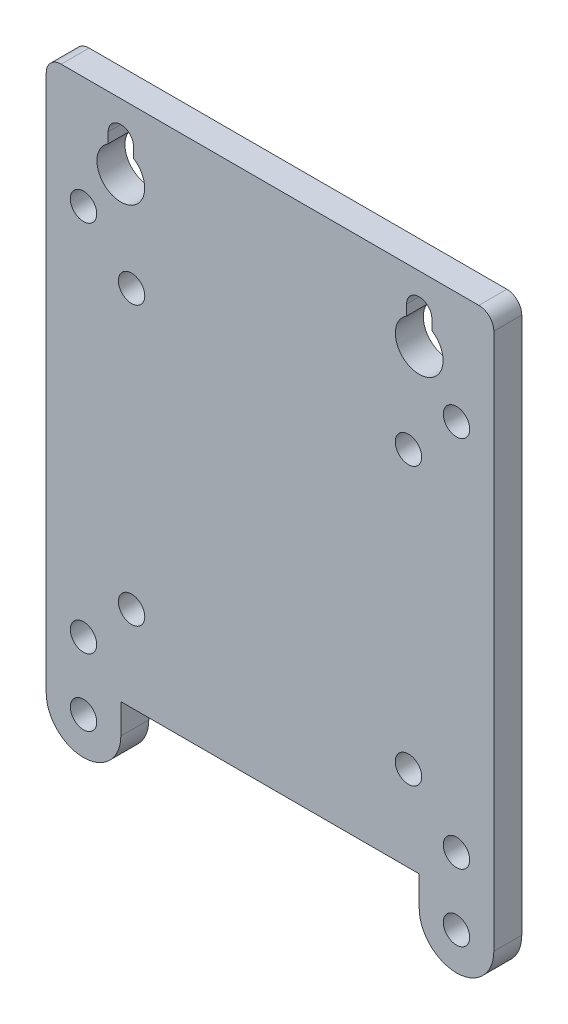
ISO-10303-21;
HEADER;
FILE_DESCRIPTION(('STEP AP214'),'2;1');
FILE_NAME('part.step','',(''),(''),'','','');
FILE_SCHEMA(('AUTOMOTIVE_DESIGN { 1 0 10303 214 1 1 1 1 }'));
ENDSEC;
DATA;
#1=APPLICATION_CONTEXT('core data for automotive mechanical design processes');
#2=APPLICATION_PROTOCOL_DEFINITION('international standard','automotive_design',2000,#1);
#3=PRODUCT_CONTEXT('',#1,'mechanical');
#4=PRODUCT('Part','Part','',(#3));
#5=PRODUCT_RELATED_PRODUCT_CATEGORY('part','',(#4));
#6=PRODUCT_DEFINITION_FORMATION('','',#4);
#7=PRODUCT_DEFINITION_CONTEXT('part definition',#1,'design');
#8=PRODUCT_DEFINITION('design','',#6,#7);
#9=PRODUCT_DEFINITION_SHAPE('','',#8);
#10=(LENGTH_UNIT() NAMED_UNIT(*) SI_UNIT(.MILLI.,.METRE.));
#11=(NAMED_UNIT(*) PLANE_ANGLE_UNIT() SI_UNIT($,.RADIAN.));
#12=(NAMED_UNIT(*) SI_UNIT($,.STERADIAN.) SOLID_ANGLE_UNIT());
#13=UNCERTAINTY_MEASURE_WITH_UNIT(LENGTH_MEASURE(1.E-05),#10,'distance_accuracy_value','');
#14=(GEOMETRIC_REPRESENTATION_CONTEXT(3) GLOBAL_UNCERTAINTY_ASSIGNED_CONTEXT((#13)) GLOBAL_UNIT_ASSIGNED_CONTEXT((#10,
#11,#12)) REPRESENTATION_CONTEXT('',''));
#15=CARTESIAN_POINT('',(0.,0.,0.));
#16=DIRECTION('',(0.,0.,1.));
#17=DIRECTION('',(1.,0.,0.));
#18=AXIS2_PLACEMENT_3D('',#15,#16,#17);
#19=CARTESIAN_POINT('',(-38.1,-38.1,4.7625));
#20=DIRECTION('',(1.,0.,0.));
#21=DIRECTION('',(0.,0.,-1.));
#22=AXIS2_PLACEMENT_3D('',#19,#20,#21);
#23=PLANE('',#22);
#24=DIRECTION('',(0.,-1.,0.));
#25=VECTOR('',#24,1.);
#26=CARTESIAN_POINT('',(-38.1,-38.1,0.));
#27=LINE('',#26,#25);
#28=CARTESIAN_POINT('',(-38.1,48.26,0.));
#29=VERTEX_POINT('',#28);
#30=CARTESIAN_POINT('',(-38.1,-43.18,0.));
#31=VERTEX_POINT('',#30);
#32=EDGE_CURVE('E479',#29,#31,#27,.T.);
#33=ORIENTED_EDGE('',*,*,#32,.T.);
#34=DIRECTION('',(0.,0.,1.));
#35=VECTOR('',#34,1.);
#36=CARTESIAN_POINT('',(-38.1,-43.18,0.));
#37=LINE('',#36,#35);
#38=CARTESIAN_POINT('',(-38.1,-43.18,4.7625));
#39=VERTEX_POINT('',#38);
#40=EDGE_CURVE('E366',#31,#39,#37,.T.);
#41=ORIENTED_EDGE('',*,*,#40,.T.);
#42=DIRECTION('',(0.,-1.,0.));
#43=VECTOR('',#42,1.);
#44=CARTESIAN_POINT('',(-38.1,-38.1,4.7625));
#45=LINE('',#44,#43);
#46=CARTESIAN_POINT('',(-38.1,48.26,4.7625));
#47=VERTEX_POINT('',#46);
#48=EDGE_CURVE('E480',#47,#39,#45,.T.);
#49=ORIENTED_EDGE('',*,*,#48,.F.);
#50=DIRECTION('',(0.,0.,-1.));
#51=VECTOR('',#50,1.);
#52=CARTESIAN_POINT('',(-38.1,48.26,4.7625));
#53=LINE('',#52,#51);
#54=EDGE_CURVE('E503',#47,#29,#53,.T.);
#55=ORIENTED_EDGE('',*,*,#54,.T.);
#56=EDGE_LOOP('',(#33,#41,#49,#55));
#57=FACE_BOUND('',#56,.T.);
#58=ADVANCED_FACE('F181',(#57),#23,.F.);
#59=CARTESIAN_POINT('',(38.1,-38.1,4.7625));
#60=DIRECTION('',(0.,1.,0.));
#61=DIRECTION('',(-1.,0.,0.));
#62=AXIS2_PLACEMENT_3D('',#59,#60,#61);
#63=PLANE('',#62);
#64=DIRECTION('',(1.,0.,0.));
#65=VECTOR('',#64,1.);
#66=CARTESIAN_POINT('',(38.1,-38.1,0.));
#67=LINE('',#66,#65);
#68=CARTESIAN_POINT('',(-25.4,-38.1,0.));
#69=VERTEX_POINT('',#68);
#70=CARTESIAN_POINT('',(25.4,-38.1,0.));
#71=VERTEX_POINT('',#70);
#72=EDGE_CURVE('E317',#69,#71,#67,.T.);
#73=ORIENTED_EDGE('',*,*,#72,.T.);
#74=DIRECTION('',(0.,0.,1.));
#75=VECTOR('',#74,1.);
#76=CARTESIAN_POINT('',(25.4,-38.1,4.7625));
#77=LINE('',#76,#75);
#78=CARTESIAN_POINT('',(25.4,-38.1,4.7625));
#79=VERTEX_POINT('',#78);
#80=EDGE_CURVE('E344',#71,#79,#77,.T.);
#81=ORIENTED_EDGE('',*,*,#80,.T.);
#82=DIRECTION('',(1.,0.,0.));
#83=VECTOR('',#82,1.);
#84=CARTESIAN_POINT('',(38.1,-38.1,4.7625));
#85=LINE('',#84,#83);
#86=CARTESIAN_POINT('',(-25.4,-38.1,4.7625));
#87=VERTEX_POINT('',#86);
#88=EDGE_CURVE('E482',#87,#79,#85,.T.);
#89=ORIENTED_EDGE('',*,*,#88,.F.);
#90=DIRECTION('',(0.,0.,-1.));
#91=VECTOR('',#90,1.);
#92=CARTESIAN_POINT('',(-25.4,-38.1,4.7625));
#93=LINE('',#92,#91);
#94=EDGE_CURVE('E369',#87,#69,#93,.T.);
#95=ORIENTED_EDGE('',*,*,#94,.T.);
#96=EDGE_LOOP('',(#73,#81,#89,#95));
#97=FACE_BOUND('',#96,.T.);
#98=ADVANCED_FACE('F538',(#97),#63,.F.);
#99=CARTESIAN_POINT('',(38.1,-38.1,4.7625));
#100=DIRECTION('',(-1.,0.,0.));
#101=DIRECTION('',(0.,0.,1.));
#102=AXIS2_PLACEMENT_3D('',#99,#100,#101);
#103=PLANE('',#102);
#104=DIRECTION('',(0.,1.,0.));
#105=VECTOR('',#104,1.);
#106=CARTESIAN_POINT('',(38.1,-38.1,4.7625));
#107=LINE('',#106,#105);
#108=CARTESIAN_POINT('',(38.1,-43.18,4.7625));
#109=VERTEX_POINT('',#108);
#110=CARTESIAN_POINT('',(38.1,48.26,4.7625));
#111=VERTEX_POINT('',#110);
#112=EDGE_CURVE('E323',#109,#111,#107,.T.);
#113=ORIENTED_EDGE('',*,*,#112,.F.);
#114=DIRECTION('',(0.,0.,1.));
#115=VECTOR('',#114,1.);
#116=CARTESIAN_POINT('',(38.1,-43.18,0.));
#117=LINE('',#116,#115);
#118=CARTESIAN_POINT('',(38.1,-43.18,0.));
#119=VERTEX_POINT('',#118);
#120=EDGE_CURVE('E320',#119,#109,#117,.T.);
#121=ORIENTED_EDGE('',*,*,#120,.F.);
#122=DIRECTION('',(0.,1.,0.));
#123=VECTOR('',#122,1.);
#124=CARTESIAN_POINT('',(38.1,-38.1,0.));
#125=LINE('',#124,#123);
#126=CARTESIAN_POINT('',(38.1,48.26,0.));
#127=VERTEX_POINT('',#126);
#128=EDGE_CURVE('E305',#119,#127,#125,.T.);
#129=ORIENTED_EDGE('',*,*,#128,.T.);
#130=DIRECTION('',(0.,0.,-1.));
#131=VECTOR('',#130,1.);
#132=CARTESIAN_POINT('',(38.1,48.26,4.7625));
#133=LINE('',#132,#131);
#134=EDGE_CURVE('E489',#127,#111,#133,.F.);
#135=ORIENTED_EDGE('',*,*,#134,.T.);
#136=EDGE_LOOP('',(#113,#121,#129,#135));
#137=FACE_BOUND('',#136,.T.);
#138=ADVANCED_FACE('F321',(#137),#103,.F.);
#139=CARTESIAN_POINT('',(38.1,50.8,4.7625));
#140=DIRECTION('',(0.,-1.,0.));
#141=DIRECTION('',(1.,0.,0.));
#142=AXIS2_PLACEMENT_3D('',#139,#140,#141);
#143=PLANE('',#142);
#144=DIRECTION('',(-1.,0.,0.));
#145=VECTOR('',#144,1.);
#146=CARTESIAN_POINT('',(38.1,50.8,0.));
#147=LINE('',#146,#145);
#148=CARTESIAN_POINT('',(35.56,50.8,0.));
#149=VERTEX_POINT('',#148);
#150=CARTESIAN_POINT('',(-35.56,50.8,0.));
#151=VERTEX_POINT('',#150);
#152=EDGE_CURVE('E316',#149,#151,#147,.T.);
#153=ORIENTED_EDGE('',*,*,#152,.T.);
#154=DIRECTION('',(0.,0.,-1.));
#155=VECTOR('',#154,1.);
#156=CARTESIAN_POINT('',(-35.56,50.8,4.7625));
#157=LINE('',#156,#155);
#158=CARTESIAN_POINT('',(-35.56,50.8,4.7625));
#159=VERTEX_POINT('',#158);
#160=EDGE_CURVE('E509',#151,#159,#157,.F.);
#161=ORIENTED_EDGE('',*,*,#160,.T.);
#162=DIRECTION('',(-1.,0.,0.));
#163=VECTOR('',#162,1.);
#164=CARTESIAN_POINT('',(38.1,50.8,4.7625));
#165=LINE('',#164,#163);
#166=CARTESIAN_POINT('',(35.56,50.8,4.7625));
#167=VERTEX_POINT('',#166);
#168=EDGE_CURVE('E486',#167,#159,#165,.T.);
#169=ORIENTED_EDGE('',*,*,#168,.F.);
#170=DIRECTION('',(0.,0.,-1.));
#171=VECTOR('',#170,1.);
#172=CARTESIAN_POINT('',(35.56,50.8,4.7625));
#173=LINE('',#172,#171);
#174=EDGE_CURVE('E506',#167,#149,#173,.T.);
#175=ORIENTED_EDGE('',*,*,#174,.T.);
#176=EDGE_LOOP('',(#153,#161,#169,#175));
#177=FACE_BOUND('',#176,.T.);
#178=ADVANCED_FACE('F655',(#177),#143,.F.);
#179=CARTESIAN_POINT('',(0.,0.,4.7625));
#180=DIRECTION('',(0.,0.,1.));
#181=DIRECTION('',(1.,0.,0.));
#182=AXIS2_PLACEMENT_3D('',#179,#180,#181);
#183=PLANE('',#182);
#184=ORIENTED_EDGE('',*,*,#88,.T.);
#185=DIRECTION('',(0.,-1.,0.));
#186=VECTOR('',#185,1.);
#187=CARTESIAN_POINT('',(25.4,-35.56,4.7625));
#188=LINE('',#187,#186);
#189=CARTESIAN_POINT('',(25.4,-43.18,4.7625));
#190=VERTEX_POINT('',#189);
#191=EDGE_CURVE('E333',#79,#190,#188,.T.);
#192=ORIENTED_EDGE('',*,*,#191,.T.);
#193=CARTESIAN_POINT('',(31.75,-43.18,4.7625));
#194=DIRECTION('',(0.,0.,1.));
#195=DIRECTION('',(-1.,0.,0.));
#196=AXIS2_PLACEMENT_3D('',#193,#194,#195);
#197=CIRCLE('',#196,6.34999999999999);
#198=EDGE_CURVE('E336',#190,#109,#197,.T.);
#199=ORIENTED_EDGE('',*,*,#198,.T.);
#200=ORIENTED_EDGE('',*,*,#112,.T.);
#201=CARTESIAN_POINT('',(35.56,48.26,4.7625));
#202=DIRECTION('',(0.,0.,1.));
#203=DIRECTION('',(1.,0.,0.));
#204=AXIS2_PLACEMENT_3D('',#201,#202,#203);
#205=CIRCLE('',#204,2.54);
#206=EDGE_CURVE('E499',#111,#167,#205,.T.);
#207=ORIENTED_EDGE('',*,*,#206,.T.);
#208=ORIENTED_EDGE('',*,*,#168,.T.);
#209=CARTESIAN_POINT('',(-35.56,48.26,4.7625));
#210=DIRECTION('',(0.,0.,1.));
#211=DIRECTION('',(1.,0.,0.));
#212=AXIS2_PLACEMENT_3D('',#209,#210,#211);
#213=CIRCLE('',#212,2.54);
#214=EDGE_CURVE('E501',#159,#47,#213,.T.);
#215=ORIENTED_EDGE('',*,*,#214,.T.);
#216=ORIENTED_EDGE('',*,*,#48,.T.);
#217=CARTESIAN_POINT('',(-31.75,-43.18,4.7625));
#218=DIRECTION('',(0.,0.,1.));
#219=DIRECTION('',(1.,0.,0.));
#220=AXIS2_PLACEMENT_3D('',#217,#218,#219);
#221=CIRCLE('',#220,6.34999999999999);
#222=CARTESIAN_POINT('',(-25.4,-43.18,4.7625));
#223=VERTEX_POINT('',#222);
#224=EDGE_CURVE('E352',#39,#223,#221,.T.);
#225=ORIENTED_EDGE('',*,*,#224,.T.);
#226=DIRECTION('',(0.,1.,0.));
#227=VECTOR('',#226,1.);
#228=CARTESIAN_POINT('',(-25.4,-35.56,4.7625));
#229=LINE('',#228,#227);
#230=EDGE_CURVE('E359',#223,#87,#229,.T.);
#231=ORIENTED_EDGE('',*,*,#230,.T.);
#232=EDGE_LOOP('',(#184,#192,#199,#200,#207,#208,#215,#216,#225,#231));
#233=FACE_BOUND('',#232,.T.);
#234=CARTESIAN_POINT('',(-31.75,31.75,4.7625));
#235=DIRECTION('',(0.,0.,-1.));
#236=DIRECTION('',(-1.,0.,0.));
#237=AXIS2_PLACEMENT_3D('',#234,#235,#236);
#238=CIRCLE('',#237,2.2479);
#239=CARTESIAN_POINT('',(-33.9979,31.75,4.7625));
#240=VERTEX_POINT('',#239);
#241=EDGE_CURVE('E376',#240,#240,#238,.T.);
#242=ORIENTED_EDGE('',*,*,#241,.T.);
#243=EDGE_LOOP('',(#242));
#244=FACE_BOUND('',#243,.T.);
#245=CARTESIAN_POINT('',(-31.75,-31.75,4.7625));
#246=DIRECTION('',(0.,0.,-1.));
#247=DIRECTION('',(-1.,0.,0.));
#248=AXIS2_PLACEMENT_3D('',#245,#246,#247);
#249=CIRCLE('',#248,2.2479);
#250=CARTESIAN_POINT('',(-33.9979,-31.75,4.7625));
#251=VERTEX_POINT('',#250);
#252=EDGE_CURVE('E382',#251,#251,#249,.T.);
#253=ORIENTED_EDGE('',*,*,#252,.T.);
#254=EDGE_LOOP('',(#253));
#255=FACE_BOUND('',#254,.T.);
#256=CARTESIAN_POINT('',(31.75,-31.75,4.7625));
#257=DIRECTION('',(0.,0.,-1.));
#258=DIRECTION('',(-1.,0.,0.));
#259=AXIS2_PLACEMENT_3D('',#256,#257,#258);
#260=CIRCLE('',#259,2.2479);
#261=CARTESIAN_POINT('',(29.5021,-31.75,4.7625));
#262=VERTEX_POINT('',#261);
#263=EDGE_CURVE('E388',#262,#262,#260,.T.);
#264=ORIENTED_EDGE('',*,*,#263,.T.);
#265=EDGE_LOOP('',(#264));
#266=FACE_BOUND('',#265,.T.);
#267=CARTESIAN_POINT('',(31.75,31.75,4.7625));
#268=DIRECTION('',(0.,0.,-1.));
#269=DIRECTION('',(-1.,0.,0.));
#270=AXIS2_PLACEMENT_3D('',#267,#268,#269);
#271=CIRCLE('',#270,2.2479);
#272=CARTESIAN_POINT('',(29.5021,31.75,4.7625));
#273=VERTEX_POINT('',#272);
#274=EDGE_CURVE('E394',#273,#273,#271,.T.);
#275=ORIENTED_EDGE('',*,*,#274,.T.);
#276=EDGE_LOOP('',(#275));
#277=FACE_BOUND('',#276,.T.);
#278=CARTESIAN_POINT('',(-25.4,39.61765,4.7625));
#279=DIRECTION('',(0.,0.,-1.));
#280=DIRECTION('',(1.,0.,0.));
#281=AXIS2_PLACEMENT_3D('',#278,#279,#280);
#282=CIRCLE('',#281,4.06400000000001);
#283=CARTESIAN_POINT('',(-23.24735,43.0647058419469,4.7625));
#284=VERTEX_POINT('',#283);
#285=CARTESIAN_POINT('',(-27.55265,43.0647058419469,4.7625));
#286=VERTEX_POINT('',#285);
#287=EDGE_CURVE('E196',#284,#286,#282,.T.);
#288=ORIENTED_EDGE('',*,*,#287,.T.);
#289=DIRECTION('',(0.,-1.,0.));
#290=VECTOR('',#289,1.);
#291=CARTESIAN_POINT('',(-27.55265,44.83735,4.7625));
#292=LINE('',#291,#290);
#293=CARTESIAN_POINT('',(-27.55265,44.83735,4.7625));
#294=VERTEX_POINT('',#293);
#295=EDGE_CURVE('E438',#294,#286,#292,.T.);
#296=ORIENTED_EDGE('',*,*,#295,.F.);
#297=CARTESIAN_POINT('',(-25.4,44.83735,4.7625));
#298=DIRECTION('',(0.,0.,-1.));
#299=DIRECTION('',(-1.,0.,0.));
#300=AXIS2_PLACEMENT_3D('',#297,#298,#299);
#301=CIRCLE('',#300,2.15265);
#302=CARTESIAN_POINT('',(-23.24735,44.83735,4.7625));
#303=VERTEX_POINT('',#302);
#304=EDGE_CURVE('E450',#294,#303,#301,.T.);
#305=ORIENTED_EDGE('',*,*,#304,.T.);
#306=DIRECTION('',(0.,-1.,0.));
#307=VECTOR('',#306,1.);
#308=CARTESIAN_POINT('',(-23.24735,44.83735,4.7625));
#309=LINE('',#308,#307);
#310=EDGE_CURVE('E435',#303,#284,#309,.T.);
#311=ORIENTED_EDGE('',*,*,#310,.T.);
#312=EDGE_LOOP('',(#288,#296,#305,#311));
#313=FACE_BOUND('',#312,.T.);
#314=CARTESIAN_POINT('',(25.4,39.61765,4.7625));
#315=DIRECTION('',(0.,0.,-1.));
#316=DIRECTION('',(-1.,0.,0.));
#317=AXIS2_PLACEMENT_3D('',#314,#315,#316);
#318=CIRCLE('',#317,4.064);
#319=CARTESIAN_POINT('',(27.55265,43.0647058419469,4.7625));
#320=VERTEX_POINT('',#319);
#321=CARTESIAN_POINT('',(23.24735,43.0647058419469,4.7625));
#322=VERTEX_POINT('',#321);
#323=EDGE_CURVE('E203',#320,#322,#318,.T.);
#324=ORIENTED_EDGE('',*,*,#323,.T.);
#325=DIRECTION('',(0.,-1.,0.));
#326=VECTOR('',#325,1.);
#327=CARTESIAN_POINT('',(23.24735,44.83735,4.7625));
#328=LINE('',#327,#326);
#329=CARTESIAN_POINT('',(23.24735,44.83735,4.7625));
#330=VERTEX_POINT('',#329);
#331=EDGE_CURVE('E415',#330,#322,#328,.T.);
#332=ORIENTED_EDGE('',*,*,#331,.F.);
#333=CARTESIAN_POINT('',(25.4,44.83735,4.7625));
#334=DIRECTION('',(0.,0.,-1.));
#335=DIRECTION('',(-1.,0.,0.));
#336=AXIS2_PLACEMENT_3D('',#333,#334,#335);
#337=CIRCLE('',#336,2.15265);
#338=CARTESIAN_POINT('',(27.55265,44.83735,4.7625));
#339=VERTEX_POINT('',#338);
#340=EDGE_CURVE('E427',#330,#339,#337,.T.);
#341=ORIENTED_EDGE('',*,*,#340,.T.);
#342=DIRECTION('',(0.,-1.,0.));
#343=VECTOR('',#342,1.);
#344=CARTESIAN_POINT('',(27.55265,44.83735,4.7625));
#345=LINE('',#344,#343);
#346=EDGE_CURVE('E412',#339,#320,#345,.T.);
#347=ORIENTED_EDGE('',*,*,#346,.T.);
#348=EDGE_LOOP('',(#324,#332,#341,#347));
#349=FACE_BOUND('',#348,.T.);
#350=CARTESIAN_POINT('',(23.5700000000001,23.5700000000001,4.7625));
#351=DIRECTION('',(0.,0.,1.));
#352=DIRECTION('',(1.,0.,0.));
#353=AXIS2_PLACEMENT_3D('',#350,#351,#352);
#354=CIRCLE('',#353,2.2479);
#355=CARTESIAN_POINT('',(25.8179000000001,23.5700000000001,4.7625));
#356=VERTEX_POINT('',#355);
#357=EDGE_CURVE('E455',#356,#356,#354,.T.);
#358=ORIENTED_EDGE('',*,*,#357,.F.);
#359=EDGE_LOOP('',(#358));
#360=FACE_BOUND('',#359,.T.);
#361=CARTESIAN_POINT('',(-23.57,23.755,4.7625));
#362=DIRECTION('',(0.,0.,1.));
#363=DIRECTION('',(1.,0.,0.));
#364=AXIS2_PLACEMENT_3D('',#361,#362,#363);
#365=CIRCLE('',#364,2.2479);
#366=CARTESIAN_POINT('',(-21.3221,23.755,4.7625));
#367=VERTEX_POINT('',#366);
#368=EDGE_CURVE('E461',#367,#367,#365,.T.);
#369=ORIENTED_EDGE('',*,*,#368,.F.);
#370=EDGE_LOOP('',(#369));
#371=FACE_BOUND('',#370,.T.);
#372=CARTESIAN_POINT('',(23.5700000000001,-23.5699999999999,4.7625));
#373=DIRECTION('',(0.,0.,1.));
#374=DIRECTION('',(1.,0.,0.));
#375=AXIS2_PLACEMENT_3D('',#372,#373,#374);
#376=CIRCLE('',#375,2.2479);
#377=CARTESIAN_POINT('',(25.8179000000001,-23.5699999999999,4.7625));
#378=VERTEX_POINT('',#377);
#379=EDGE_CURVE('E467',#378,#378,#376,.T.);
#380=ORIENTED_EDGE('',*,*,#379,.F.);
#381=EDGE_LOOP('',(#380));
#382=FACE_BOUND('',#381,.T.);
#383=CARTESIAN_POINT('',(-23.57,-23.5699999999999,4.7625));
#384=DIRECTION('',(0.,0.,1.));
#385=DIRECTION('',(1.,0.,0.));
#386=AXIS2_PLACEMENT_3D('',#383,#384,#385);
#387=CIRCLE('',#386,2.2479);
#388=CARTESIAN_POINT('',(-21.3221,-23.5699999999999,4.7625));
#389=VERTEX_POINT('',#388);
#390=EDGE_CURVE('E473',#389,#389,#387,.T.);
#391=ORIENTED_EDGE('',*,*,#390,.F.);
#392=EDGE_LOOP('',(#391));
#393=FACE_BOUND('',#392,.T.);
#394=CARTESIAN_POINT('',(-31.75,-43.18,4.7625));
#395=DIRECTION('',(0.,0.,1.));
#396=DIRECTION('',(1.,0.,0.));
#397=AXIS2_PLACEMENT_3D('',#394,#395,#396);
#398=CIRCLE('',#397,2.2479);
#399=CARTESIAN_POINT('',(-29.5021,-43.18,4.7625));
#400=VERTEX_POINT('',#399);
#401=EDGE_CURVE('E348',#400,#400,#398,.T.);
#402=ORIENTED_EDGE('',*,*,#401,.F.);
#403=EDGE_LOOP('',(#402));
#404=FACE_BOUND('',#403,.T.);
#405=CARTESIAN_POINT('',(31.75,-43.18,4.7625));
#406=DIRECTION('',(0.,0.,1.));
#407=DIRECTION('',(-1.,0.,0.));
#408=AXIS2_PLACEMENT_3D('',#405,#406,#407);
#409=CIRCLE('',#408,2.2479);
#410=CARTESIAN_POINT('',(33.9979,-43.18,4.7625));
#411=VERTEX_POINT('',#410);
#412=EDGE_CURVE('E339',#411,#411,#409,.T.);
#413=ORIENTED_EDGE('',*,*,#412,.F.);
#414=EDGE_LOOP('',(#413));
#415=FACE_BOUND('',#414,.T.);
#416=ADVANCED_FACE('F515',(#233,#244,#255,#266,#277,#313,#349,#360,#371,#382,#393,#404,#415),
#183,.T.);
#417=CARTESIAN_POINT('',(0.,0.,0.));
#418=DIRECTION('',(0.,0.,1.));
#419=DIRECTION('',(1.,0.,0.));
#420=AXIS2_PLACEMENT_3D('',#417,#418,#419);
#421=PLANE('',#420);
#422=DIRECTION('',(0.,-1.,0.));
#423=VECTOR('',#422,1.);
#424=CARTESIAN_POINT('',(25.4,-35.56,0.));
#425=LINE('',#424,#423);
#426=CARTESIAN_POINT('',(25.4,-43.18,0.));
#427=VERTEX_POINT('',#426);
#428=EDGE_CURVE('E328',#71,#427,#425,.T.);
#429=ORIENTED_EDGE('',*,*,#428,.F.);
#430=ORIENTED_EDGE('',*,*,#72,.F.);
#431=DIRECTION('',(0.,1.,0.));
#432=VECTOR('',#431,1.);
#433=CARTESIAN_POINT('',(-25.4,-35.56,0.));
#434=LINE('',#433,#432);
#435=CARTESIAN_POINT('',(-25.4,-43.18,0.));
#436=VERTEX_POINT('',#435);
#437=EDGE_CURVE('E358',#436,#69,#434,.T.);
#438=ORIENTED_EDGE('',*,*,#437,.F.);
#439=CARTESIAN_POINT('',(-31.75,-43.18,0.));
#440=DIRECTION('',(0.,0.,1.));
#441=DIRECTION('',(1.,0.,0.));
#442=AXIS2_PLACEMENT_3D('',#439,#440,#441);
#443=CIRCLE('',#442,6.34999999999999);
#444=EDGE_CURVE('E355',#31,#436,#443,.T.);
#445=ORIENTED_EDGE('',*,*,#444,.F.);
#446=ORIENTED_EDGE('',*,*,#32,.F.);
#447=CARTESIAN_POINT('',(-35.56,48.26,0.));
#448=DIRECTION('',(0.,0.,1.));
#449=DIRECTION('',(1.,0.,0.));
#450=AXIS2_PLACEMENT_3D('',#447,#448,#449);
#451=CIRCLE('',#450,2.54);
#452=EDGE_CURVE('E497',#29,#151,#451,.F.);
#453=ORIENTED_EDGE('',*,*,#452,.T.);
#454=ORIENTED_EDGE('',*,*,#152,.F.);
#455=CARTESIAN_POINT('',(35.56,48.26,0.));
#456=DIRECTION('',(0.,0.,1.));
#457=DIRECTION('',(1.,0.,0.));
#458=AXIS2_PLACEMENT_3D('',#455,#456,#457);
#459=CIRCLE('',#458,2.54);
#460=EDGE_CURVE('E313',#149,#127,#459,.F.);
#461=ORIENTED_EDGE('',*,*,#460,.T.);
#462=ORIENTED_EDGE('',*,*,#128,.F.);
#463=CARTESIAN_POINT('',(31.75,-43.18,0.));
#464=DIRECTION('',(0.,0.,1.));
#465=DIRECTION('',(-1.,0.,0.));
#466=AXIS2_PLACEMENT_3D('',#463,#464,#465);
#467=CIRCLE('',#466,6.34999999999999);
#468=EDGE_CURVE('E311',#427,#119,#467,.T.);
#469=ORIENTED_EDGE('',*,*,#468,.F.);
#470=EDGE_LOOP('',(#429,#430,#438,#445,#446,#453,#454,#461,#462,#469));
#471=FACE_BOUND('',#470,.T.);
#472=CARTESIAN_POINT('',(-31.75,31.75,0.));
#473=DIRECTION('',(0.,0.,-1.));
#474=DIRECTION('',(-1.,0.,0.));
#475=AXIS2_PLACEMENT_3D('',#472,#473,#474);
#476=CIRCLE('',#475,2.2479);
#477=CARTESIAN_POINT('',(-33.9979,31.75,0.));
#478=VERTEX_POINT('',#477);
#479=EDGE_CURVE('E373',#478,#478,#476,.T.);
#480=ORIENTED_EDGE('',*,*,#479,.F.);
#481=EDGE_LOOP('',(#480));
#482=FACE_BOUND('',#481,.T.);
#483=CARTESIAN_POINT('',(-31.75,-31.75,0.));
#484=DIRECTION('',(0.,0.,-1.));
#485=DIRECTION('',(-1.,0.,0.));
#486=AXIS2_PLACEMENT_3D('',#483,#484,#485);
#487=CIRCLE('',#486,2.2479);
#488=CARTESIAN_POINT('',(-33.9979,-31.75,0.));
#489=VERTEX_POINT('',#488);
#490=EDGE_CURVE('E379',#489,#489,#487,.T.);
#491=ORIENTED_EDGE('',*,*,#490,.F.);
#492=EDGE_LOOP('',(#491));
#493=FACE_BOUND('',#492,.T.);
#494=CARTESIAN_POINT('',(31.75,-31.75,0.));
#495=DIRECTION('',(0.,0.,-1.));
#496=DIRECTION('',(-1.,0.,0.));
#497=AXIS2_PLACEMENT_3D('',#494,#495,#496);
#498=CIRCLE('',#497,2.2479);
#499=CARTESIAN_POINT('',(29.5021,-31.75,0.));
#500=VERTEX_POINT('',#499);
#501=EDGE_CURVE('E385',#500,#500,#498,.T.);
#502=ORIENTED_EDGE('',*,*,#501,.F.);
#503=EDGE_LOOP('',(#502));
#504=FACE_BOUND('',#503,.T.);
#505=CARTESIAN_POINT('',(31.75,31.75,0.));
#506=DIRECTION('',(0.,0.,-1.));
#507=DIRECTION('',(-1.,0.,0.));
#508=AXIS2_PLACEMENT_3D('',#505,#506,#507);
#509=CIRCLE('',#508,2.2479);
#510=CARTESIAN_POINT('',(29.5021,31.75,0.));
#511=VERTEX_POINT('',#510);
#512=EDGE_CURVE('E391',#511,#511,#509,.T.);
#513=ORIENTED_EDGE('',*,*,#512,.F.);
#514=EDGE_LOOP('',(#513));
#515=FACE_BOUND('',#514,.T.);
#516=DIRECTION('',(0.,-1.,0.));
#517=VECTOR('',#516,1.);
#518=CARTESIAN_POINT('',(23.24735,44.83735,0.));
#519=LINE('',#518,#517);
#520=CARTESIAN_POINT('',(23.2473500000001,44.83735,0.));
#521=VERTEX_POINT('',#520);
#522=CARTESIAN_POINT('',(23.24735,43.0647058419469,0.));
#523=VERTEX_POINT('',#522);
#524=EDGE_CURVE('E418',#521,#523,#519,.T.);
#525=ORIENTED_EDGE('',*,*,#524,.T.);
#526=CARTESIAN_POINT('',(25.4,39.61765,0.));
#527=DIRECTION('',(0.,0.,-1.));
#528=DIRECTION('',(-1.,0.,0.));
#529=AXIS2_PLACEMENT_3D('',#526,#527,#528);
#530=CIRCLE('',#529,4.064);
#531=CARTESIAN_POINT('',(27.55265,43.0647058419469,0.));
#532=VERTEX_POINT('',#531);
#533=EDGE_CURVE('E403',#532,#523,#530,.T.);
#534=ORIENTED_EDGE('',*,*,#533,.F.);
#535=DIRECTION('',(0.,-1.,0.));
#536=VECTOR('',#535,1.);
#537=CARTESIAN_POINT('',(27.55265,44.83735,0.));
#538=LINE('',#537,#536);
#539=CARTESIAN_POINT('',(27.55265,44.83735,0.));
#540=VERTEX_POINT('',#539);
#541=EDGE_CURVE('E409',#540,#532,#538,.T.);
#542=ORIENTED_EDGE('',*,*,#541,.F.);
#543=CARTESIAN_POINT('',(25.4,44.83735,0.));
#544=DIRECTION('',(0.,0.,-1.));
#545=DIRECTION('',(-1.,0.,0.));
#546=AXIS2_PLACEMENT_3D('',#543,#544,#545);
#547=CIRCLE('',#546,2.15265);
#548=EDGE_CURVE('E424',#521,#540,#547,.T.);
#549=ORIENTED_EDGE('',*,*,#548,.F.);
#550=EDGE_LOOP('',(#525,#534,#542,#549));
#551=FACE_BOUND('',#550,.T.);
#552=DIRECTION('',(0.,-1.,0.));
#553=VECTOR('',#552,1.);
#554=CARTESIAN_POINT('',(-27.55265,44.83735,0.));
#555=LINE('',#554,#553);
#556=CARTESIAN_POINT('',(-27.5526500000001,44.83735,0.));
#557=VERTEX_POINT('',#556);
#558=CARTESIAN_POINT('',(-27.55265,43.0647058419469,0.));
#559=VERTEX_POINT('',#558);
#560=EDGE_CURVE('E441',#557,#559,#555,.T.);
#561=ORIENTED_EDGE('',*,*,#560,.T.);
#562=CARTESIAN_POINT('',(-25.4,39.61765,0.));
#563=DIRECTION('',(0.,0.,-1.));
#564=DIRECTION('',(1.,0.,0.));
#565=AXIS2_PLACEMENT_3D('',#562,#563,#564);
#566=CIRCLE('',#565,4.06400000000001);
#567=CARTESIAN_POINT('',(-23.24735,43.0647058419469,0.));
#568=VERTEX_POINT('',#567);
#569=EDGE_CURVE('E397',#568,#559,#566,.T.);
#570=ORIENTED_EDGE('',*,*,#569,.F.);
#571=DIRECTION('',(0.,-1.,0.));
#572=VECTOR('',#571,1.);
#573=CARTESIAN_POINT('',(-23.24735,44.83735,0.));
#574=LINE('',#573,#572);
#575=CARTESIAN_POINT('',(-23.24735,44.83735,0.));
#576=VERTEX_POINT('',#575);
#577=EDGE_CURVE('E432',#576,#568,#574,.T.);
#578=ORIENTED_EDGE('',*,*,#577,.F.);
#579=CARTESIAN_POINT('',(-25.4,44.83735,0.));
#580=DIRECTION('',(0.,0.,-1.));
#581=DIRECTION('',(-1.,0.,0.));
#582=AXIS2_PLACEMENT_3D('',#579,#580,#581);
#583=CIRCLE('',#582,2.15265);
#584=EDGE_CURVE('E447',#557,#576,#583,.T.);
#585=ORIENTED_EDGE('',*,*,#584,.F.);
#586=EDGE_LOOP('',(#561,#570,#578,#585));
#587=FACE_BOUND('',#586,.T.);
#588=CARTESIAN_POINT('',(23.5700000000001,23.5700000000001,0.));
#589=DIRECTION('',(0.,0.,1.));
#590=DIRECTION('',(1.,0.,0.));
#591=AXIS2_PLACEMENT_3D('',#588,#589,#590);
#592=CIRCLE('',#591,2.2479);
#593=CARTESIAN_POINT('',(25.8179,23.5700000000001,0.));
#594=VERTEX_POINT('',#593);
#595=EDGE_CURVE('E458',#594,#594,#592,.T.);
#596=ORIENTED_EDGE('',*,*,#595,.T.);
#597=EDGE_LOOP('',(#596));
#598=FACE_BOUND('',#597,.T.);
#599=CARTESIAN_POINT('',(-23.57,23.755,0.));
#600=DIRECTION('',(0.,0.,1.));
#601=DIRECTION('',(1.,0.,0.));
#602=AXIS2_PLACEMENT_3D('',#599,#600,#601);
#603=CIRCLE('',#602,2.2479);
#604=CARTESIAN_POINT('',(-21.3221,23.755,0.));
#605=VERTEX_POINT('',#604);
#606=EDGE_CURVE('E464',#605,#605,#603,.T.);
#607=ORIENTED_EDGE('',*,*,#606,.T.);
#608=EDGE_LOOP('',(#607));
#609=FACE_BOUND('',#608,.T.);
#610=CARTESIAN_POINT('',(23.5700000000001,-23.5699999999999,0.));
#611=DIRECTION('',(0.,0.,1.));
#612=DIRECTION('',(1.,0.,0.));
#613=AXIS2_PLACEMENT_3D('',#610,#611,#612);
#614=CIRCLE('',#613,2.2479);
#615=CARTESIAN_POINT('',(25.8179000000001,-23.5699999999999,0.));
#616=VERTEX_POINT('',#615);
#617=EDGE_CURVE('E470',#616,#616,#614,.T.);
#618=ORIENTED_EDGE('',*,*,#617,.T.);
#619=EDGE_LOOP('',(#618));
#620=FACE_BOUND('',#619,.T.);
#621=CARTESIAN_POINT('',(-23.57,-23.5699999999999,0.));
#622=DIRECTION('',(0.,0.,1.));
#623=DIRECTION('',(1.,0.,0.));
#624=AXIS2_PLACEMENT_3D('',#621,#622,#623);
#625=CIRCLE('',#624,2.2479);
#626=CARTESIAN_POINT('',(-21.3221,-23.5699999999999,0.));
#627=VERTEX_POINT('',#626);
#628=EDGE_CURVE('E476',#627,#627,#625,.T.);
#629=ORIENTED_EDGE('',*,*,#628,.T.);
#630=EDGE_LOOP('',(#629));
#631=FACE_BOUND('',#630,.T.);
#632=CARTESIAN_POINT('',(-31.75,-43.18,0.));
#633=DIRECTION('',(0.,0.,1.));
#634=DIRECTION('',(1.,0.,0.));
#635=AXIS2_PLACEMENT_3D('',#632,#633,#634);
#636=CIRCLE('',#635,2.2479);
#637=CARTESIAN_POINT('',(-29.5021,-43.18,0.));
#638=VERTEX_POINT('',#637);
#639=EDGE_CURVE('E349',#638,#638,#636,.T.);
#640=ORIENTED_EDGE('',*,*,#639,.T.);
#641=EDGE_LOOP('',(#640));
#642=FACE_BOUND('',#641,.T.);
#643=CARTESIAN_POINT('',(31.75,-43.18,0.));
#644=DIRECTION('',(0.,0.,1.));
#645=DIRECTION('',(-1.,0.,0.));
#646=AXIS2_PLACEMENT_3D('',#643,#644,#645);
#647=CIRCLE('',#646,2.2479);
#648=CARTESIAN_POINT('',(33.9979,-43.18,0.));
#649=VERTEX_POINT('',#648);
#650=EDGE_CURVE('E342',#649,#649,#647,.T.);
#651=ORIENTED_EDGE('',*,*,#650,.T.);
#652=EDGE_LOOP('',(#651));
#653=FACE_BOUND('',#652,.T.);
#654=ADVANCED_FACE('F308',(#471,#482,#493,#504,#515,#551,#587,#598,#609,#620,#631,#642,#653),
#421,.F.);
#655=CARTESIAN_POINT('',(-23.57,-23.5699999999999,4.7625));
#656=DIRECTION('',(0.,0.,1.));
#657=DIRECTION('',(1.,0.,0.));
#658=AXIS2_PLACEMENT_3D('',#655,#656,#657);
#659=CYLINDRICAL_SURFACE('',#658,2.2479);
#660=ORIENTED_EDGE('',*,*,#628,.F.);
#661=EDGE_LOOP('',(#660));
#662=FACE_BOUND('',#661,.T.);
#663=ORIENTED_EDGE('',*,*,#390,.T.);
#664=EDGE_LOOP('',(#663));
#665=FACE_BOUND('',#664,.T.);
#666=ADVANCED_FACE('F672',(#662,#665),#659,.F.);
#667=CARTESIAN_POINT('',(23.5700000000001,-23.5699999999999,4.7625));
#668=DIRECTION('',(0.,0.,1.));
#669=DIRECTION('',(1.,0.,0.));
#670=AXIS2_PLACEMENT_3D('',#667,#668,#669);
#671=CYLINDRICAL_SURFACE('',#670,2.2479);
#672=ORIENTED_EDGE('',*,*,#617,.F.);
#673=EDGE_LOOP('',(#672));
#674=FACE_BOUND('',#673,.T.);
#675=ORIENTED_EDGE('',*,*,#379,.T.);
#676=EDGE_LOOP('',(#675));
#677=FACE_BOUND('',#676,.T.);
#678=ADVANCED_FACE('F747',(#674,#677),#671,.F.);
#679=CARTESIAN_POINT('',(-23.57,23.755,4.7625));
#680=DIRECTION('',(0.,0.,1.));
#681=DIRECTION('',(1.,0.,0.));
#682=AXIS2_PLACEMENT_3D('',#679,#680,#681);
#683=CYLINDRICAL_SURFACE('',#682,2.2479);
#684=ORIENTED_EDGE('',*,*,#606,.F.);
#685=EDGE_LOOP('',(#684));
#686=FACE_BOUND('',#685,.T.);
#687=ORIENTED_EDGE('',*,*,#368,.T.);
#688=EDGE_LOOP('',(#687));
#689=FACE_BOUND('',#688,.T.);
#690=ADVANCED_FACE('F559',(#686,#689),#683,.F.);
#691=CARTESIAN_POINT('',(23.5700000000001,23.5700000000001,4.7625));
#692=DIRECTION('',(0.,0.,1.));
#693=DIRECTION('',(1.,0.,0.));
#694=AXIS2_PLACEMENT_3D('',#691,#692,#693);
#695=CYLINDRICAL_SURFACE('',#694,2.2479);
#696=ORIENTED_EDGE('',*,*,#595,.F.);
#697=EDGE_LOOP('',(#696));
#698=FACE_BOUND('',#697,.T.);
#699=ORIENTED_EDGE('',*,*,#357,.T.);
#700=EDGE_LOOP('',(#699));
#701=FACE_BOUND('',#700,.T.);
#702=ADVANCED_FACE('F551',(#698,#701),#695,.F.);
#703=CARTESIAN_POINT('',(-35.56,48.26,4.7625));
#704=DIRECTION('',(0.,0.,-1.));
#705=DIRECTION('',(-1.,0.,0.));
#706=AXIS2_PLACEMENT_3D('',#703,#704,#705);
#707=CYLINDRICAL_SURFACE('',#706,2.54);
#708=ORIENTED_EDGE('',*,*,#214,.F.);
#709=ORIENTED_EDGE('',*,*,#160,.F.);
#710=ORIENTED_EDGE('',*,*,#452,.F.);
#711=ORIENTED_EDGE('',*,*,#54,.F.);
#712=EDGE_LOOP('',(#708,#709,#710,#711));
#713=FACE_BOUND('',#712,.T.);
#714=ADVANCED_FACE('F549',(#713),#707,.T.);
#715=CARTESIAN_POINT('',(35.56,48.26,4.7625));
#716=DIRECTION('',(0.,0.,-1.));
#717=DIRECTION('',(-1.,0.,0.));
#718=AXIS2_PLACEMENT_3D('',#715,#716,#717);
#719=CYLINDRICAL_SURFACE('',#718,2.54);
#720=ORIENTED_EDGE('',*,*,#206,.F.);
#721=ORIENTED_EDGE('',*,*,#134,.F.);
#722=ORIENTED_EDGE('',*,*,#460,.F.);
#723=ORIENTED_EDGE('',*,*,#174,.F.);
#724=EDGE_LOOP('',(#720,#721,#722,#723));
#725=FACE_BOUND('',#724,.T.);
#726=ADVANCED_FACE('F183',(#725),#719,.T.);
#727=CARTESIAN_POINT('',(-25.4,44.83735,0.));
#728=DIRECTION('',(0.,0.,-1.));
#729=DIRECTION('',(-1.,0.,0.));
#730=AXIS2_PLACEMENT_3D('',#727,#728,#729);
#731=CYLINDRICAL_SURFACE('',#730,2.15265);
#732=ORIENTED_EDGE('',*,*,#584,.T.);
#733=DIRECTION('',(0.,0.,1.));
#734=VECTOR('',#733,1.);
#735=CARTESIAN_POINT('',(-23.24735,44.83735,4.7625));
#736=LINE('',#735,#734);
#737=EDGE_CURVE('E444',#576,#303,#736,.T.);
#738=ORIENTED_EDGE('',*,*,#737,.T.);
#739=ORIENTED_EDGE('',*,*,#304,.F.);
#740=DIRECTION('',(0.,0.,-1.));
#741=VECTOR('',#740,1.);
#742=CARTESIAN_POINT('',(-27.55265,44.83735,0.));
#743=LINE('',#742,#741);
#744=EDGE_CURVE('E453',#557,#294,#743,.F.);
#745=ORIENTED_EDGE('',*,*,#744,.F.);
#746=EDGE_LOOP('',(#732,#738,#739,#745));
#747=FACE_BOUND('',#746,.T.);
#748=ADVANCED_FACE('F557',(#747),#731,.F.);
#749=CARTESIAN_POINT('',(-27.55265,44.83735,0.));
#750=DIRECTION('',(-1.,0.,0.));
#751=DIRECTION('',(0.,0.,1.));
#752=AXIS2_PLACEMENT_3D('',#749,#750,#751);
#753=PLANE('',#752);
#754=ORIENTED_EDGE('',*,*,#295,.T.);
#755=DIRECTION('',(0.,0.,-1.));
#756=VECTOR('',#755,1.);
#757=CARTESIAN_POINT('',(-27.55265,43.0647058419469,4.7625));
#758=LINE('',#757,#756);
#759=EDGE_CURVE('E399',#286,#559,#758,.T.);
#760=ORIENTED_EDGE('',*,*,#759,.T.);
#761=ORIENTED_EDGE('',*,*,#560,.F.);
#762=ORIENTED_EDGE('',*,*,#744,.T.);
#763=EDGE_LOOP('',(#754,#760,#761,#762));
#764=FACE_BOUND('',#763,.T.);
#765=ADVANCED_FACE('F787',(#764),#753,.F.);
#766=CARTESIAN_POINT('',(-23.24735,44.83735,4.7625));
#767=DIRECTION('',(1.,0.,0.));
#768=DIRECTION('',(0.,0.,-1.));
#769=AXIS2_PLACEMENT_3D('',#766,#767,#768);
#770=PLANE('',#769);
#771=ORIENTED_EDGE('',*,*,#577,.T.);
#772=DIRECTION('',(0.,0.,-1.));
#773=VECTOR('',#772,1.);
#774=CARTESIAN_POINT('',(-23.24735,43.0647058419469,4.7625));
#775=LINE('',#774,#773);
#776=EDGE_CURVE('E13',#568,#284,#775,.F.);
#777=ORIENTED_EDGE('',*,*,#776,.T.);
#778=ORIENTED_EDGE('',*,*,#310,.F.);
#779=ORIENTED_EDGE('',*,*,#737,.F.);
#780=EDGE_LOOP('',(#771,#777,#778,#779));
#781=FACE_BOUND('',#780,.T.);
#782=ADVANCED_FACE('F535',(#781),#770,.F.);
#783=CARTESIAN_POINT('',(25.4,44.83735,0.));
#784=DIRECTION('',(0.,0.,-1.));
#785=DIRECTION('',(-1.,0.,0.));
#786=AXIS2_PLACEMENT_3D('',#783,#784,#785);
#787=CYLINDRICAL_SURFACE('',#786,2.15265);
#788=ORIENTED_EDGE('',*,*,#548,.T.);
#789=DIRECTION('',(0.,0.,1.));
#790=VECTOR('',#789,1.);
#791=CARTESIAN_POINT('',(27.55265,44.83735,4.7625));
#792=LINE('',#791,#790);
#793=EDGE_CURVE('E421',#540,#339,#792,.T.);
#794=ORIENTED_EDGE('',*,*,#793,.T.);
#795=ORIENTED_EDGE('',*,*,#340,.F.);
#796=DIRECTION('',(0.,0.,-1.));
#797=VECTOR('',#796,1.);
#798=CARTESIAN_POINT('',(23.24735,44.83735,0.));
#799=LINE('',#798,#797);
#800=EDGE_CURVE('E430',#521,#330,#799,.F.);
#801=ORIENTED_EDGE('',*,*,#800,.F.);
#802=EDGE_LOOP('',(#788,#794,#795,#801));
#803=FACE_BOUND('',#802,.T.);
#804=ADVANCED_FACE('F521',(#803),#787,.F.);
#805=CARTESIAN_POINT('',(23.24735,44.83735,0.));
#806=DIRECTION('',(-1.,0.,0.));
#807=DIRECTION('',(0.,0.,1.));
#808=AXIS2_PLACEMENT_3D('',#805,#806,#807);
#809=PLANE('',#808);
#810=ORIENTED_EDGE('',*,*,#331,.T.);
#811=DIRECTION('',(0.,0.,-1.));
#812=VECTOR('',#811,1.);
#813=CARTESIAN_POINT('',(23.24735,43.0647058419469,4.7625));
#814=LINE('',#813,#812);
#815=EDGE_CURVE('E405',#322,#523,#814,.T.);
#816=ORIENTED_EDGE('',*,*,#815,.T.);
#817=ORIENTED_EDGE('',*,*,#524,.F.);
#818=ORIENTED_EDGE('',*,*,#800,.T.);
#819=EDGE_LOOP('',(#810,#816,#817,#818));
#820=FACE_BOUND('',#819,.T.);
#821=ADVANCED_FACE('F527',(#820),#809,.F.);
#822=CARTESIAN_POINT('',(27.55265,44.83735,4.7625));
#823=DIRECTION('',(1.,0.,0.));
#824=DIRECTION('',(0.,0.,-1.));
#825=AXIS2_PLACEMENT_3D('',#822,#823,#824);
#826=PLANE('',#825);
#827=ORIENTED_EDGE('',*,*,#541,.T.);
#828=DIRECTION('',(0.,0.,-1.));
#829=VECTOR('',#828,1.);
#830=CARTESIAN_POINT('',(27.55265,43.0647058419469,4.7625));
#831=LINE('',#830,#829);
#832=EDGE_CURVE('E189',#532,#320,#831,.F.);
#833=ORIENTED_EDGE('',*,*,#832,.T.);
#834=ORIENTED_EDGE('',*,*,#346,.F.);
#835=ORIENTED_EDGE('',*,*,#793,.F.);
#836=EDGE_LOOP('',(#827,#833,#834,#835));
#837=FACE_BOUND('',#836,.T.);
#838=ADVANCED_FACE('F511',(#837),#826,.F.);
#839=CARTESIAN_POINT('',(25.4,39.61765,4.7625));
#840=DIRECTION('',(0.,0.,-1.));
#841=DIRECTION('',(-1.,0.,0.));
#842=AXIS2_PLACEMENT_3D('',#839,#840,#841);
#843=CYLINDRICAL_SURFACE('',#842,4.064);
#844=ORIENTED_EDGE('',*,*,#323,.F.);
#845=ORIENTED_EDGE('',*,*,#832,.F.);
#846=ORIENTED_EDGE('',*,*,#533,.T.);
#847=ORIENTED_EDGE('',*,*,#815,.F.);
#848=EDGE_LOOP('',(#844,#845,#846,#847));
#849=FACE_BOUND('',#848,.T.);
#850=ADVANCED_FACE('F525',(#849),#843,.F.);
#851=CARTESIAN_POINT('',(-25.4,39.61765,4.7625));
#852=DIRECTION('',(0.,0.,-1.));
#853=DIRECTION('',(-1.,0.,0.));
#854=AXIS2_PLACEMENT_3D('',#851,#852,#853);
#855=CYLINDRICAL_SURFACE('',#854,4.06400000000001);
#856=ORIENTED_EDGE('',*,*,#287,.F.);
#857=ORIENTED_EDGE('',*,*,#776,.F.);
#858=ORIENTED_EDGE('',*,*,#569,.T.);
#859=ORIENTED_EDGE('',*,*,#759,.F.);
#860=EDGE_LOOP('',(#856,#857,#858,#859));
#861=FACE_BOUND('',#860,.T.);
#862=ADVANCED_FACE('F608',(#861),#855,.F.);
#863=CARTESIAN_POINT('',(31.75,31.75,0.));
#864=DIRECTION('',(0.,0.,-1.));
#865=DIRECTION('',(-1.,0.,0.));
#866=AXIS2_PLACEMENT_3D('',#863,#864,#865);
#867=CYLINDRICAL_SURFACE('',#866,2.2479);
#868=ORIENTED_EDGE('',*,*,#274,.F.);
#869=EDGE_LOOP('',(#868));
#870=FACE_BOUND('',#869,.T.);
#871=ORIENTED_EDGE('',*,*,#512,.T.);
#872=EDGE_LOOP('',(#871));
#873=FACE_BOUND('',#872,.T.);
#874=ADVANCED_FACE('F604',(#870,#873),#867,.F.);
#875=CARTESIAN_POINT('',(31.75,-31.75,0.));
#876=DIRECTION('',(0.,0.,-1.));
#877=DIRECTION('',(-1.,0.,0.));
#878=AXIS2_PLACEMENT_3D('',#875,#876,#877);
#879=CYLINDRICAL_SURFACE('',#878,2.2479);
#880=ORIENTED_EDGE('',*,*,#263,.F.);
#881=EDGE_LOOP('',(#880));
#882=FACE_BOUND('',#881,.T.);
#883=ORIENTED_EDGE('',*,*,#501,.T.);
#884=EDGE_LOOP('',(#883));
#885=FACE_BOUND('',#884,.T.);
#886=ADVANCED_FACE('F600',(#882,#885),#879,.F.);
#887=CARTESIAN_POINT('',(-31.75,-31.75,0.));
#888=DIRECTION('',(0.,0.,-1.));
#889=DIRECTION('',(-1.,0.,0.));
#890=AXIS2_PLACEMENT_3D('',#887,#888,#889);
#891=CYLINDRICAL_SURFACE('',#890,2.2479);
#892=ORIENTED_EDGE('',*,*,#252,.F.);
#893=EDGE_LOOP('',(#892));
#894=FACE_BOUND('',#893,.T.);
#895=ORIENTED_EDGE('',*,*,#490,.T.);
#896=EDGE_LOOP('',(#895));
#897=FACE_BOUND('',#896,.T.);
#898=ADVANCED_FACE('F592',(#894,#897),#891,.F.);
#899=CARTESIAN_POINT('',(-31.75,31.75,0.));
#900=DIRECTION('',(0.,0.,-1.));
#901=DIRECTION('',(-1.,0.,0.));
#902=AXIS2_PLACEMENT_3D('',#899,#900,#901);
#903=CYLINDRICAL_SURFACE('',#902,2.2479);
#904=ORIENTED_EDGE('',*,*,#241,.F.);
#905=EDGE_LOOP('',(#904));
#906=FACE_BOUND('',#905,.T.);
#907=ORIENTED_EDGE('',*,*,#479,.T.);
#908=EDGE_LOOP('',(#907));
#909=FACE_BOUND('',#908,.T.);
#910=ADVANCED_FACE('F584',(#906,#909),#903,.F.);
#911=CARTESIAN_POINT('',(-25.4,-35.56,0.));
#912=DIRECTION('',(1.,0.,0.));
#913=DIRECTION('',(0.,0.,-1.));
#914=AXIS2_PLACEMENT_3D('',#911,#912,#913);
#915=PLANE('',#914);
#916=ORIENTED_EDGE('',*,*,#94,.F.);
#917=ORIENTED_EDGE('',*,*,#230,.F.);
#918=DIRECTION('',(0.,0.,1.));
#919=VECTOR('',#918,1.);
#920=CARTESIAN_POINT('',(-25.4,-43.18,0.));
#921=LINE('',#920,#919);
#922=EDGE_CURVE('E361',#436,#223,#921,.T.);
#923=ORIENTED_EDGE('',*,*,#922,.F.);
#924=ORIENTED_EDGE('',*,*,#437,.T.);
#925=EDGE_LOOP('',(#916,#917,#923,#924));
#926=FACE_BOUND('',#925,.T.);
#927=ADVANCED_FACE('F582',(#926),#915,.T.);
#928=CARTESIAN_POINT('',(-31.75,-43.18,0.));
#929=DIRECTION('',(0.,0.,1.));
#930=DIRECTION('',(1.,0.,0.));
#931=AXIS2_PLACEMENT_3D('',#928,#929,#930);
#932=CYLINDRICAL_SURFACE('',#931,6.34999999999999);
#933=ORIENTED_EDGE('',*,*,#224,.F.);
#934=ORIENTED_EDGE('',*,*,#40,.F.);
#935=ORIENTED_EDGE('',*,*,#444,.T.);
#936=ORIENTED_EDGE('',*,*,#922,.T.);
#937=EDGE_LOOP('',(#933,#934,#935,#936));
#938=FACE_BOUND('',#937,.T.);
#939=ADVANCED_FACE('F574',(#938),#932,.T.);
#940=CARTESIAN_POINT('',(-31.75,-43.18,0.));
#941=DIRECTION('',(0.,0.,1.));
#942=DIRECTION('',(1.,0.,0.));
#943=AXIS2_PLACEMENT_3D('',#940,#941,#942);
#944=CYLINDRICAL_SURFACE('',#943,2.2479);
#945=CARTESIAN_POINT('',(-29.5021,-43.18,0.));
#946=CARTESIAN_POINT('',(-29.5021,-43.18,0.049609375));
#947=CARTESIAN_POINT('',(-29.5021,-43.18,0.09921875));
#948=CARTESIAN_POINT('',(-29.5021,-43.18,0.1984375));
#949=CARTESIAN_POINT('',(-29.5021,-43.18,0.248046875));
#950=CARTESIAN_POINT('',(-29.5021,-43.18,0.347265625));
#951=CARTESIAN_POINT('',(-29.5021,-43.18,0.396875));
#952=CARTESIAN_POINT('',(-29.5021,-43.18,0.49609375));
#953=CARTESIAN_POINT('',(-29.5021,-43.18,0.545703125));
#954=CARTESIAN_POINT('',(-29.5021,-43.18,0.644921875));
#955=CARTESIAN_POINT('',(-29.5021,-43.18,0.69453125));
#956=CARTESIAN_POINT('',(-29.5021,-43.18,0.79375));
#957=CARTESIAN_POINT('',(-29.5021,-43.18,0.843359375));
#958=CARTESIAN_POINT('',(-29.5021,-43.18,0.942578125));
#959=CARTESIAN_POINT('',(-29.5021,-43.18,0.9921875));
#960=CARTESIAN_POINT('',(-29.5021,-43.18,1.09140625));
#961=CARTESIAN_POINT('',(-29.5021,-43.18,1.141015625));
#962=CARTESIAN_POINT('',(-29.5021,-43.18,1.240234375));
#963=CARTESIAN_POINT('',(-29.5021,-43.18,1.28984375));
#964=CARTESIAN_POINT('',(-29.5021,-43.18,1.3890625));
#965=CARTESIAN_POINT('',(-29.5021,-43.18,1.438671875));
#966=CARTESIAN_POINT('',(-29.5021,-43.18,1.537890625));
#967=CARTESIAN_POINT('',(-29.5021,-43.18,1.5875));
#968=CARTESIAN_POINT('',(-29.5021,-43.18,1.68671875));
#969=CARTESIAN_POINT('',(-29.5021,-43.18,1.736328125));
#970=CARTESIAN_POINT('',(-29.5021,-43.18,1.835546875));
#971=CARTESIAN_POINT('',(-29.5021,-43.18,1.88515625));
#972=CARTESIAN_POINT('',(-29.5021,-43.18,1.984375));
#973=CARTESIAN_POINT('',(-29.5021,-43.18,2.033984375));
#974=CARTESIAN_POINT('',(-29.5021,-43.18,2.133203125));
#975=CARTESIAN_POINT('',(-29.5021,-43.18,2.1828125));
#976=CARTESIAN_POINT('',(-29.5021,-43.18,2.28203125));
#977=CARTESIAN_POINT('',(-29.5021,-43.18,2.331640625));
#978=CARTESIAN_POINT('',(-29.5021,-43.18,2.430859375));
#979=CARTESIAN_POINT('',(-29.5021,-43.18,2.48046875));
#980=CARTESIAN_POINT('',(-29.5021,-43.18,2.5796875));
#981=CARTESIAN_POINT('',(-29.5021,-43.18,2.629296875));
#982=CARTESIAN_POINT('',(-29.5021,-43.18,2.728515625));
#983=CARTESIAN_POINT('',(-29.5021,-43.18,2.778125));
#984=CARTESIAN_POINT('',(-29.5021,-43.18,2.87734375));
#985=CARTESIAN_POINT('',(-29.5021,-43.18,2.926953125));
#986=CARTESIAN_POINT('',(-29.5021,-43.18,3.026171875));
#987=CARTESIAN_POINT('',(-29.5021,-43.18,3.07578125));
#988=CARTESIAN_POINT('',(-29.5021,-43.18,3.175));
#989=CARTESIAN_POINT('',(-29.5021,-43.18,3.224609375));
#990=CARTESIAN_POINT('',(-29.5021,-43.18,3.323828125));
#991=CARTESIAN_POINT('',(-29.5021,-43.18,3.3734375));
#992=CARTESIAN_POINT('',(-29.5021,-43.18,3.47265625));
#993=CARTESIAN_POINT('',(-29.5021,-43.18,3.522265625));
#994=CARTESIAN_POINT('',(-29.5021,-43.18,3.621484375));
#995=CARTESIAN_POINT('',(-29.5021,-43.18,3.67109375));
#996=CARTESIAN_POINT('',(-29.5021,-43.18,3.7703125));
#997=CARTESIAN_POINT('',(-29.5021,-43.18,3.819921875));
#998=CARTESIAN_POINT('',(-29.5021,-43.18,3.919140625));
#999=CARTESIAN_POINT('',(-29.5021,-43.18,3.96875));
#1000=CARTESIAN_POINT('',(-29.5021,-43.18,4.06796875));
#1001=CARTESIAN_POINT('',(-29.5021,-43.18,4.117578125));
#1002=CARTESIAN_POINT('',(-29.5021,-43.18,4.216796875));
#1003=CARTESIAN_POINT('',(-29.5021,-43.18,4.26640625));
#1004=CARTESIAN_POINT('',(-29.5021,-43.18,4.365625));
#1005=CARTESIAN_POINT('',(-29.5021,-43.18,4.415234375));
#1006=CARTESIAN_POINT('',(-29.5021,-43.18,4.514453125));
#1007=CARTESIAN_POINT('',(-29.5021,-43.18,4.5640625));
#1008=CARTESIAN_POINT('',(-29.5021,-43.18,4.66328125));
#1009=CARTESIAN_POINT('',(-29.5021,-43.18,4.712890625));
#1010=CARTESIAN_POINT('',(-29.5021,-43.18,4.7625));
#1011=B_SPLINE_CURVE_WITH_KNOTS('',3,(#945,#946,#947,#948,#949,#950,#951,#952,#953,#954,#955,
#956,#957,#958,#959,#960,#961,#962,#963,#964,#965,#966,#967,#968,#969,#970,#971,#972,#973,#974,
#975,#976,#977,#978,#979,#980,#981,#982,#983,#984,#985,#986,#987,#988,#989,#990,#991,#992,#993,
#994,#995,#996,#997,#998,#999,#1000,#1001,#1002,#1003,#1004,#1005,#1006,#1007,#1008,#1009,
#1010),.UNSPECIFIED.,.F.,.F.,(4,2,2,2,2,2,2,2,2,2,2,2,2,2,2,2,2,2,2,2,2,2,2,2,2,2,2,2,2,2,2,2,
4),(0.,0.148828125,0.29765625,0.446484375,0.5953125,0.744140625,0.89296875,1.041796875,1.190625,
1.339453125,1.48828125,1.637109375,1.7859375,1.934765625,2.08359375,2.232421875,2.38125,
2.530078125,2.67890625,2.827734375,2.9765625,3.125390625,3.27421875,3.423046875,3.571875,
3.720703125,3.86953125,4.018359375,4.1671875,4.316015625,4.46484375,4.613671875,4.7625),.UNSPECIFIED.);
#1012=EDGE_CURVE('BSEAM590',#638,#400,#1011,.T.);
#1013=ORIENTED_EDGE('',*,*,#639,.F.);
#1014=ORIENTED_EDGE('',*,*,#401,.T.);
#1015=ORIENTED_EDGE('',*,*,#1012,.T.);
#1016=ORIENTED_EDGE('',*,*,#1012,.F.);
#1017=EDGE_LOOP('',(#1013,#1015,#1014,#1016));
#1018=FACE_BOUND('',#1017,.T.);
#1019=ADVANCED_FACE('F590',(#1018),#944,.F.);
#1020=CARTESIAN_POINT('',(25.4,-35.56,0.));
#1021=DIRECTION('',(-1.,0.,0.));
#1022=DIRECTION('',(0.,0.,1.));
#1023=AXIS2_PLACEMENT_3D('',#1020,#1021,#1022);
#1024=PLANE('',#1023);
#1025=ORIENTED_EDGE('',*,*,#80,.F.);
#1026=ORIENTED_EDGE('',*,*,#428,.T.);
#1027=DIRECTION('',(0.,0.,1.));
#1028=VECTOR('',#1027,1.);
#1029=CARTESIAN_POINT('',(25.4,-43.18,0.));
#1030=LINE('',#1029,#1028);
#1031=EDGE_CURVE('E327',#427,#190,#1030,.T.);
#1032=ORIENTED_EDGE('',*,*,#1031,.T.);
#1033=ORIENTED_EDGE('',*,*,#191,.F.);
#1034=EDGE_LOOP('',(#1025,#1026,#1032,#1033));
#1035=FACE_BOUND('',#1034,.T.);
#1036=ADVANCED_FACE('F580',(#1035),#1024,.T.);
#1037=CARTESIAN_POINT('',(31.75,-43.18,0.));
#1038=DIRECTION('',(0.,0.,1.));
#1039=DIRECTION('',(1.,0.,0.));
#1040=AXIS2_PLACEMENT_3D('',#1037,#1038,#1039);
#1041=CYLINDRICAL_SURFACE('',#1040,6.34999999999999);
#1042=ORIENTED_EDGE('',*,*,#198,.F.);
#1043=ORIENTED_EDGE('',*,*,#1031,.F.);
#1044=ORIENTED_EDGE('',*,*,#468,.T.);
#1045=ORIENTED_EDGE('',*,*,#120,.T.);
#1046=EDGE_LOOP('',(#1042,#1043,#1044,#1045));
#1047=FACE_BOUND('',#1046,.T.);
#1048=ADVANCED_FACE('F331',(#1047),#1041,.T.);
#1049=CARTESIAN_POINT('',(31.75,-43.18,0.));
#1050=DIRECTION('',(0.,0.,1.));
#1051=DIRECTION('',(1.,0.,0.));
#1052=AXIS2_PLACEMENT_3D('',#1049,#1050,#1051);
#1053=CYLINDRICAL_SURFACE('',#1052,2.2479);
#1054=CARTESIAN_POINT('',(33.9979,-43.18,0.));
#1055=CARTESIAN_POINT('',(33.9979,-43.18,0.049609375));
#1056=CARTESIAN_POINT('',(33.9979,-43.18,0.09921875));
#1057=CARTESIAN_POINT('',(33.9979,-43.18,0.1984375));
#1058=CARTESIAN_POINT('',(33.9979,-43.18,0.248046875));
#1059=CARTESIAN_POINT('',(33.9979,-43.18,0.347265625));
#1060=CARTESIAN_POINT('',(33.9979,-43.18,0.396875));
#1061=CARTESIAN_POINT('',(33.9979,-43.18,0.49609375));
#1062=CARTESIAN_POINT('',(33.9979,-43.18,0.545703125));
#1063=CARTESIAN_POINT('',(33.9979,-43.18,0.644921875));
#1064=CARTESIAN_POINT('',(33.9979,-43.18,0.69453125));
#1065=CARTESIAN_POINT('',(33.9979,-43.18,0.79375));
#1066=CARTESIAN_POINT('',(33.9979,-43.18,0.843359375));
#1067=CARTESIAN_POINT('',(33.9979,-43.18,0.942578125));
#1068=CARTESIAN_POINT('',(33.9979,-43.18,0.9921875));
#1069=CARTESIAN_POINT('',(33.9979,-43.18,1.09140625));
#1070=CARTESIAN_POINT('',(33.9979,-43.18,1.141015625));
#1071=CARTESIAN_POINT('',(33.9979,-43.18,1.240234375));
#1072=CARTESIAN_POINT('',(33.9979,-43.18,1.28984375));
#1073=CARTESIAN_POINT('',(33.9979,-43.18,1.3890625));
#1074=CARTESIAN_POINT('',(33.9979,-43.18,1.438671875));
#1075=CARTESIAN_POINT('',(33.9979,-43.18,1.537890625));
#1076=CARTESIAN_POINT('',(33.9979,-43.18,1.5875));
#1077=CARTESIAN_POINT('',(33.9979,-43.18,1.68671875));
#1078=CARTESIAN_POINT('',(33.9979,-43.18,1.736328125));
#1079=CARTESIAN_POINT('',(33.9979,-43.18,1.835546875));
#1080=CARTESIAN_POINT('',(33.9979,-43.18,1.88515625));
#1081=CARTESIAN_POINT('',(33.9979,-43.18,1.984375));
#1082=CARTESIAN_POINT('',(33.9979,-43.18,2.033984375));
#1083=CARTESIAN_POINT('',(33.9979,-43.18,2.133203125));
#1084=CARTESIAN_POINT('',(33.9979,-43.18,2.1828125));
#1085=CARTESIAN_POINT('',(33.9979,-43.18,2.28203125));
#1086=CARTESIAN_POINT('',(33.9979,-43.18,2.331640625));
#1087=CARTESIAN_POINT('',(33.9979,-43.18,2.430859375));
#1088=CARTESIAN_POINT('',(33.9979,-43.18,2.48046875));
#1089=CARTESIAN_POINT('',(33.9979,-43.18,2.5796875));
#1090=CARTESIAN_POINT('',(33.9979,-43.18,2.629296875));
#1091=CARTESIAN_POINT('',(33.9979,-43.18,2.728515625));
#1092=CARTESIAN_POINT('',(33.9979,-43.18,2.778125));
#1093=CARTESIAN_POINT('',(33.9979,-43.18,2.87734375));
#1094=CARTESIAN_POINT('',(33.9979,-43.18,2.926953125));
#1095=CARTESIAN_POINT('',(33.9979,-43.18,3.026171875));
#1096=CARTESIAN_POINT('',(33.9979,-43.18,3.07578125));
#1097=CARTESIAN_POINT('',(33.9979,-43.18,3.175));
#1098=CARTESIAN_POINT('',(33.9979,-43.18,3.224609375));
#1099=CARTESIAN_POINT('',(33.9979,-43.18,3.323828125));
#1100=CARTESIAN_POINT('',(33.9979,-43.18,3.3734375));
#1101=CARTESIAN_POINT('',(33.9979,-43.18,3.47265625));
#1102=CARTESIAN_POINT('',(33.9979,-43.18,3.522265625));
#1103=CARTESIAN_POINT('',(33.9979,-43.18,3.621484375));
#1104=CARTESIAN_POINT('',(33.9979,-43.18,3.67109375));
#1105=CARTESIAN_POINT('',(33.9979,-43.18,3.7703125));
#1106=CARTESIAN_POINT('',(33.9979,-43.18,3.819921875));
#1107=CARTESIAN_POINT('',(33.9979,-43.18,3.919140625));
#1108=CARTESIAN_POINT('',(33.9979,-43.18,3.96875));
#1109=CARTESIAN_POINT('',(33.9979,-43.18,4.06796875));
#1110=CARTESIAN_POINT('',(33.9979,-43.18,4.117578125));
#1111=CARTESIAN_POINT('',(33.9979,-43.18,4.216796875));
#1112=CARTESIAN_POINT('',(33.9979,-43.18,4.26640625));
#1113=CARTESIAN_POINT('',(33.9979,-43.18,4.365625));
#1114=CARTESIAN_POINT('',(33.9979,-43.18,4.415234375));
#1115=CARTESIAN_POINT('',(33.9979,-43.18,4.514453125));
#1116=CARTESIAN_POINT('',(33.9979,-43.18,4.5640625));
#1117=CARTESIAN_POINT('',(33.9979,-43.18,4.66328125));
#1118=CARTESIAN_POINT('',(33.9979,-43.18,4.712890625));
#1119=CARTESIAN_POINT('',(33.9979,-43.18,4.7625));
#1120=B_SPLINE_CURVE_WITH_KNOTS('',3,(#1054,#1055,#1056,#1057,#1058,#1059,#1060,#1061,#1062,
#1063,#1064,#1065,#1066,#1067,#1068,#1069,#1070,#1071,#1072,#1073,#1074,#1075,#1076,#1077,#1078,
#1079,#1080,#1081,#1082,#1083,#1084,#1085,#1086,#1087,#1088,#1089,#1090,#1091,#1092,#1093,#1094,
#1095,#1096,#1097,#1098,#1099,#1100,#1101,#1102,#1103,#1104,#1105,#1106,#1107,#1108,#1109,#1110,
#1111,#1112,#1113,#1114,#1115,#1116,#1117,#1118,#1119),.UNSPECIFIED.,.F.,.F.,(4,2,2,2,2,2,2,2,2,
2,2,2,2,2,2,2,2,2,2,2,2,2,2,2,2,2,2,2,2,2,2,2,4),(0.,0.148828125,0.29765625,0.446484375,
0.5953125,0.744140625,0.89296875,1.041796875,1.190625,1.339453125,1.48828125,1.637109375,
1.7859375,1.934765625,2.08359375,2.232421875,2.38125,2.530078125,2.67890625,2.827734375,
2.9765625,3.125390625,3.27421875,3.423046875,3.571875,3.720703125,3.86953125,4.018359375,
4.1671875,4.316015625,4.46484375,4.613671875,4.7625),.UNSPECIFIED.);
#1121=EDGE_CURVE('BSEAM708',#649,#411,#1120,.T.);
#1122=ORIENTED_EDGE('',*,*,#650,.F.);
#1123=ORIENTED_EDGE('',*,*,#412,.T.);
#1124=ORIENTED_EDGE('',*,*,#1121,.T.);
#1125=ORIENTED_EDGE('',*,*,#1121,.F.);
#1126=EDGE_LOOP('',(#1122,#1124,#1123,#1125));
#1127=FACE_BOUND('',#1126,.T.);
#1128=ADVANCED_FACE('F708',(#1127),#1053,.F.);
#1129=CLOSED_SHELL('',(#58,#98,#138,#178,#416,#654,#666,#678,#690,#702,#714,#726,#748,#765,#782,
#804,#821,#838,#850,#862,#874,#886,#898,#910,#927,#939,#1019,#1036,#1048,#1128));
#1130=MANIFOLD_SOLID_BREP('B2',#1129);
#1131=ADVANCED_BREP_SHAPE_REPRESENTATION('',(#18,#1130),#14);
#1132=SHAPE_DEFINITION_REPRESENTATION(#9,#1131);
ENDSEC;
END-ISO-10303-21;
